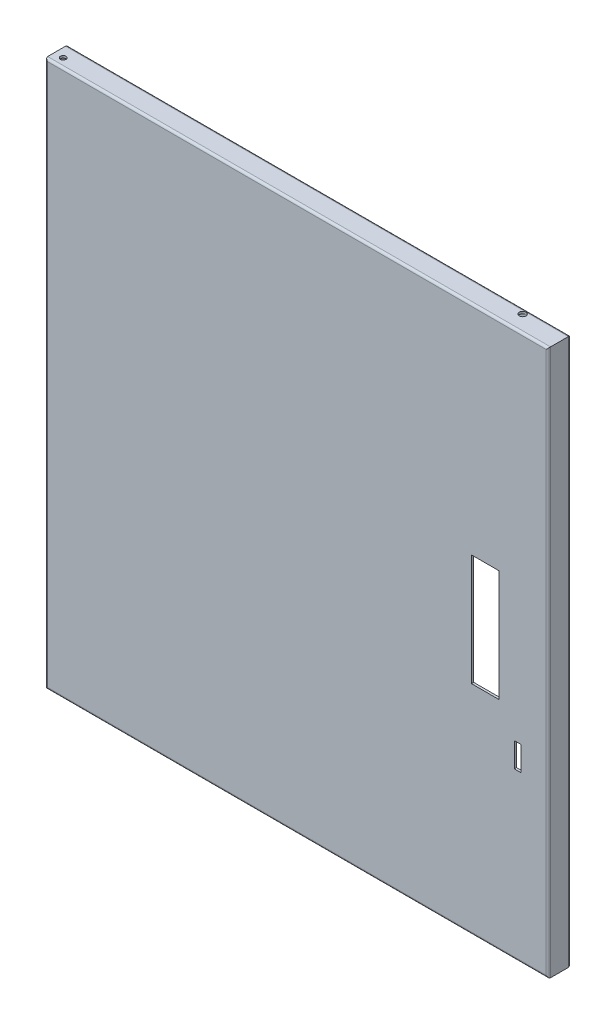
ISO-10303-21;
HEADER;
FILE_DESCRIPTION(('STEP AP214'),'2;1');
FILE_NAME('part.step','',(''),(''),'','','');
FILE_SCHEMA(('AUTOMOTIVE_DESIGN { 1 0 10303 214 1 1 1 1 }'));
ENDSEC;
DATA;
#1=APPLICATION_CONTEXT('core data for automotive mechanical design processes');
#2=APPLICATION_PROTOCOL_DEFINITION('international standard','automotive_design',2000,#1);
#3=PRODUCT_CONTEXT('',#1,'mechanical');
#4=PRODUCT('Part','Part','',(#3));
#5=PRODUCT_RELATED_PRODUCT_CATEGORY('part','',(#4));
#6=PRODUCT_DEFINITION_FORMATION('','',#4);
#7=PRODUCT_DEFINITION_CONTEXT('part definition',#1,'design');
#8=PRODUCT_DEFINITION('design','',#6,#7);
#9=PRODUCT_DEFINITION_SHAPE('','',#8);
#10=(LENGTH_UNIT() NAMED_UNIT(*) SI_UNIT(.MILLI.,.METRE.));
#11=(NAMED_UNIT(*) PLANE_ANGLE_UNIT() SI_UNIT($,.RADIAN.));
#12=(NAMED_UNIT(*) SI_UNIT($,.STERADIAN.) SOLID_ANGLE_UNIT());
#13=UNCERTAINTY_MEASURE_WITH_UNIT(LENGTH_MEASURE(1.E-05),#10,'distance_accuracy_value','');
#14=(GEOMETRIC_REPRESENTATION_CONTEXT(3) GLOBAL_UNCERTAINTY_ASSIGNED_CONTEXT((#13)) GLOBAL_UNIT_ASSIGNED_CONTEXT((#10,
#11,#12)) REPRESENTATION_CONTEXT('',''));
#15=CARTESIAN_POINT('',(0.,0.,0.));
#16=DIRECTION('',(0.,0.,1.));
#17=DIRECTION('',(1.,0.,0.));
#18=AXIS2_PLACEMENT_3D('',#15,#16,#17);
#19=CARTESIAN_POINT('',(0.,0.,20.));
#20=DIRECTION('',(0.,0.,1.));
#21=DIRECTION('',(1.,0.,0.));
#22=AXIS2_PLACEMENT_3D('',#19,#20,#21);
#23=PLANE('',#22);
#24=DIRECTION('',(0.,1.,0.));
#25=VECTOR('',#24,1.);
#26=CARTESIAN_POINT('',(181.5,0.,20.));
#27=LINE('',#26,#25);
#28=CARTESIAN_POINT('',(181.5,-50.,20.));
#29=VERTEX_POINT('',#28);
#30=CARTESIAN_POINT('',(181.5,50.,20.));
#31=VERTEX_POINT('',#30);
#32=EDGE_CURVE('E261',#29,#31,#27,.T.);
#33=ORIENTED_EDGE('',*,*,#32,.F.);
#34=DIRECTION('',(-1.,0.,0.));
#35=VECTOR('',#34,1.);
#36=CARTESIAN_POINT('',(0.,-50.,20.));
#37=LINE('',#36,#35);
#38=CARTESIAN_POINT('',(156.5,-50.,20.));
#39=VERTEX_POINT('',#38);
#40=EDGE_CURVE('E272',#29,#39,#37,.T.);
#41=ORIENTED_EDGE('',*,*,#40,.T.);
#42=DIRECTION('',(0.,1.,0.));
#43=VECTOR('',#42,1.);
#44=CARTESIAN_POINT('',(156.5,0.,20.));
#45=LINE('',#44,#43);
#46=CARTESIAN_POINT('',(156.5,50.,20.));
#47=VERTEX_POINT('',#46);
#48=EDGE_CURVE('E73',#39,#47,#45,.T.);
#49=ORIENTED_EDGE('',*,*,#48,.T.);
#50=DIRECTION('',(-1.,0.,0.));
#51=VECTOR('',#50,1.);
#52=CARTESIAN_POINT('',(0.,50.,20.));
#53=LINE('',#52,#51);
#54=EDGE_CURVE('E267',#31,#47,#53,.T.);
#55=ORIENTED_EDGE('',*,*,#54,.F.);
#56=EDGE_LOOP('',(#33,#41,#49,#55));
#57=FACE_BOUND('',#56,.T.);
#58=DIRECTION('',(-1.,0.,0.));
#59=VECTOR('',#58,1.);
#60=CARTESIAN_POINT('',(-225.5,243.,20.));
#61=LINE('',#60,#59);
#62=CARTESIAN_POINT('',(223.5,243.,20.));
#63=VERTEX_POINT('',#62);
#64=CARTESIAN_POINT('',(-223.5,243.,20.));
#65=VERTEX_POINT('',#64);
#66=EDGE_CURVE('E412',#63,#65,#61,.T.);
#67=ORIENTED_EDGE('',*,*,#66,.T.);
#68=DIRECTION('',(0.,-1.,0.));
#69=VECTOR('',#68,1.);
#70=CARTESIAN_POINT('',(-223.5,-245.,20.));
#71=LINE('',#70,#69);
#72=CARTESIAN_POINT('',(-223.5,-243.,20.));
#73=VERTEX_POINT('',#72);
#74=EDGE_CURVE('E418',#65,#73,#71,.T.);
#75=ORIENTED_EDGE('',*,*,#74,.T.);
#76=DIRECTION('',(1.,0.,0.));
#77=VECTOR('',#76,1.);
#78=CARTESIAN_POINT('',(225.5,-243.,20.));
#79=LINE('',#78,#77);
#80=CARTESIAN_POINT('',(223.5,-243.,20.));
#81=VERTEX_POINT('',#80);
#82=EDGE_CURVE('E416',#73,#81,#79,.T.);
#83=ORIENTED_EDGE('',*,*,#82,.T.);
#84=DIRECTION('',(0.,1.,0.));
#85=VECTOR('',#84,1.);
#86=CARTESIAN_POINT('',(223.5,245.,20.));
#87=LINE('',#86,#85);
#88=EDGE_CURVE('E414',#81,#63,#87,.T.);
#89=ORIENTED_EDGE('',*,*,#88,.T.);
#90=EDGE_LOOP('',(#67,#75,#83,#89));
#91=FACE_BOUND('',#90,.T.);
#92=DIRECTION('',(0.,1.,0.));
#93=VECTOR('',#92,1.);
#94=CARTESIAN_POINT('',(201.,0.,20.));
#95=LINE('',#94,#93);
#96=CARTESIAN_POINT('',(201.,-96.9999999999999,20.));
#97=VERTEX_POINT('',#96);
#98=CARTESIAN_POINT('',(201.,-75.,20.));
#99=VERTEX_POINT('',#98);
#100=EDGE_CURVE('E307',#97,#99,#95,.T.);
#101=ORIENTED_EDGE('',*,*,#100,.F.);
#102=DIRECTION('',(-1.,0.,0.));
#103=VECTOR('',#102,1.);
#104=CARTESIAN_POINT('',(0.,-96.9999999999999,20.));
#105=LINE('',#104,#103);
#106=CARTESIAN_POINT('',(195.,-96.9999999999999,20.));
#107=VERTEX_POINT('',#106);
#108=EDGE_CURVE('E81',#97,#107,#105,.T.);
#109=ORIENTED_EDGE('',*,*,#108,.T.);
#110=DIRECTION('',(0.,1.,0.));
#111=VECTOR('',#110,1.);
#112=CARTESIAN_POINT('',(195.,0.,20.));
#113=LINE('',#112,#111);
#114=CARTESIAN_POINT('',(195.,-75.,20.));
#115=VERTEX_POINT('',#114);
#116=EDGE_CURVE('E284',#107,#115,#113,.T.);
#117=ORIENTED_EDGE('',*,*,#116,.T.);
#118=DIRECTION('',(-1.,0.,0.));
#119=VECTOR('',#118,1.);
#120=CARTESIAN_POINT('',(0.,-75.,20.));
#121=LINE('',#120,#119);
#122=EDGE_CURVE('E296',#99,#115,#121,.T.);
#123=ORIENTED_EDGE('',*,*,#122,.F.);
#124=EDGE_LOOP('',(#101,#109,#117,#123));
#125=FACE_BOUND('',#124,.T.);
#126=ADVANCED_FACE('F56',(#57,#91,#125),#23,.T.);
#127=CARTESIAN_POINT('',(0.,0.,18.));
#128=DIRECTION('',(0.,0.,-1.));
#129=DIRECTION('',(-1.,0.,0.));
#130=AXIS2_PLACEMENT_3D('',#127,#128,#129);
#131=PLANE('',#130);
#132=DIRECTION('',(0.,1.,0.));
#133=VECTOR('',#132,1.);
#134=CARTESIAN_POINT('',(181.5,0.,18.));
#135=LINE('',#134,#133);
#136=CARTESIAN_POINT('',(181.5,-50.,18.));
#137=VERTEX_POINT('',#136);
#138=CARTESIAN_POINT('',(181.5,50.,18.));
#139=VERTEX_POINT('',#138);
#140=EDGE_CURVE('E258',#137,#139,#135,.T.);
#141=ORIENTED_EDGE('',*,*,#140,.T.);
#142=DIRECTION('',(-1.,0.,0.));
#143=VECTOR('',#142,1.);
#144=CARTESIAN_POINT('',(0.,50.,18.));
#145=LINE('',#144,#143);
#146=CARTESIAN_POINT('',(156.5,50.,18.));
#147=VERTEX_POINT('',#146);
#148=EDGE_CURVE('E244',#139,#147,#145,.T.);
#149=ORIENTED_EDGE('',*,*,#148,.T.);
#150=DIRECTION('',(0.,1.,0.));
#151=VECTOR('',#150,1.);
#152=CARTESIAN_POINT('',(156.5,0.,18.));
#153=LINE('',#152,#151);
#154=CARTESIAN_POINT('',(156.5,-50.,18.));
#155=VERTEX_POINT('',#154);
#156=EDGE_CURVE('E275',#155,#147,#153,.T.);
#157=ORIENTED_EDGE('',*,*,#156,.F.);
#158=DIRECTION('',(-1.,0.,0.));
#159=VECTOR('',#158,1.);
#160=CARTESIAN_POINT('',(0.,-50.,18.));
#161=LINE('',#160,#159);
#162=EDGE_CURVE('E266',#137,#155,#161,.T.);
#163=ORIENTED_EDGE('',*,*,#162,.F.);
#164=EDGE_LOOP('',(#141,#149,#157,#163));
#165=FACE_BOUND('',#164,.T.);
#166=DIRECTION('',(0.,1.,0.));
#167=VECTOR('',#166,1.);
#168=CARTESIAN_POINT('',(221.5,-243.,18.));
#169=LINE('',#168,#167);
#170=CARTESIAN_POINT('',(221.5,241.,18.));
#171=VERTEX_POINT('',#170);
#172=CARTESIAN_POINT('',(221.5,-241.,18.));
#173=VERTEX_POINT('',#172);
#174=EDGE_CURVE('E448',#171,#173,#169,.F.);
#175=ORIENTED_EDGE('',*,*,#174,.T.);
#176=DIRECTION('',(1.,0.,0.));
#177=VECTOR('',#176,1.);
#178=CARTESIAN_POINT('',(0.,-241.,18.));
#179=LINE('',#178,#177);
#180=CARTESIAN_POINT('',(-221.5,-241.,18.));
#181=VERTEX_POINT('',#180);
#182=EDGE_CURVE('E450',#173,#181,#179,.F.);
#183=ORIENTED_EDGE('',*,*,#182,.T.);
#184=DIRECTION('',(0.,-1.,0.));
#185=VECTOR('',#184,1.);
#186=CARTESIAN_POINT('',(-221.5,0.,18.));
#187=LINE('',#186,#185);
#188=CARTESIAN_POINT('',(-221.5,241.,18.));
#189=VERTEX_POINT('',#188);
#190=EDGE_CURVE('E444',#181,#189,#187,.F.);
#191=ORIENTED_EDGE('',*,*,#190,.T.);
#192=DIRECTION('',(-1.,0.,0.));
#193=VECTOR('',#192,1.);
#194=CARTESIAN_POINT('',(223.5,241.,18.));
#195=LINE('',#194,#193);
#196=EDGE_CURVE('E446',#189,#171,#195,.F.);
#197=ORIENTED_EDGE('',*,*,#196,.T.);
#198=EDGE_LOOP('',(#175,#183,#191,#197));
#199=FACE_BOUND('',#198,.T.);
#200=DIRECTION('',(0.,1.,0.));
#201=VECTOR('',#200,1.);
#202=CARTESIAN_POINT('',(195.,0.,18.));
#203=LINE('',#202,#201);
#204=CARTESIAN_POINT('',(195.,-96.9999999999999,18.));
#205=VERTEX_POINT('',#204);
#206=CARTESIAN_POINT('',(195.,-75.,18.));
#207=VERTEX_POINT('',#206);
#208=EDGE_CURVE('E297',#205,#207,#203,.T.);
#209=ORIENTED_EDGE('',*,*,#208,.F.);
#210=DIRECTION('',(-1.,0.,0.));
#211=VECTOR('',#210,1.);
#212=CARTESIAN_POINT('',(0.,-96.9999999999999,18.));
#213=LINE('',#212,#211);
#214=CARTESIAN_POINT('',(201.,-96.9999999999999,18.));
#215=VERTEX_POINT('',#214);
#216=EDGE_CURVE('E293',#215,#205,#213,.T.);
#217=ORIENTED_EDGE('',*,*,#216,.F.);
#218=DIRECTION('',(0.,1.,0.));
#219=VECTOR('',#218,1.);
#220=CARTESIAN_POINT('',(201.,0.,18.));
#221=LINE('',#220,#219);
#222=CARTESIAN_POINT('',(201.,-75.,18.));
#223=VERTEX_POINT('',#222);
#224=EDGE_CURVE('E289',#215,#223,#221,.T.);
#225=ORIENTED_EDGE('',*,*,#224,.T.);
#226=DIRECTION('',(-1.,0.,0.));
#227=VECTOR('',#226,1.);
#228=CARTESIAN_POINT('',(0.,-75.,18.));
#229=LINE('',#228,#227);
#230=EDGE_CURVE('E292',#223,#207,#229,.T.);
#231=ORIENTED_EDGE('',*,*,#230,.T.);
#232=EDGE_LOOP('',(#209,#217,#225,#231));
#233=FACE_BOUND('',#232,.T.);
#234=ADVANCED_FACE('F264',(#165,#199,#233),#131,.T.);
#235=CARTESIAN_POINT('',(225.5,245.,20.));
#236=DIRECTION('',(-1.,0.,0.));
#237=DIRECTION('',(0.,-1.,0.));
#238=AXIS2_PLACEMENT_3D('',#235,#236,#237);
#239=PLANE('',#238);
#240=DIRECTION('',(0.,0.,-1.));
#241=VECTOR('',#240,1.);
#242=CARTESIAN_POINT('',(225.5,-245.,20.));
#243=LINE('',#242,#241);
#244=CARTESIAN_POINT('',(225.5,-245.,18.));
#245=VERTEX_POINT('',#244);
#246=CARTESIAN_POINT('',(225.5,-245.,2.));
#247=VERTEX_POINT('',#246);
#248=EDGE_CURVE('E365',#245,#247,#243,.T.);
#249=ORIENTED_EDGE('',*,*,#248,.T.);
#250=DIRECTION('',(0.,1.,0.));
#251=VECTOR('',#250,1.);
#252=CARTESIAN_POINT('',(225.5,245.,2.));
#253=LINE('',#252,#251);
#254=CARTESIAN_POINT('',(225.5,245.,2.));
#255=VERTEX_POINT('',#254);
#256=EDGE_CURVE('E392',#247,#255,#253,.T.);
#257=ORIENTED_EDGE('',*,*,#256,.T.);
#258=DIRECTION('',(0.,0.,-1.));
#259=VECTOR('',#258,1.);
#260=CARTESIAN_POINT('',(225.5,245.,20.));
#261=LINE('',#260,#259);
#262=CARTESIAN_POINT('',(225.5,245.,18.));
#263=VERTEX_POINT('',#262);
#264=EDGE_CURVE('E376',#263,#255,#261,.T.);
#265=ORIENTED_EDGE('',*,*,#264,.F.);
#266=DIRECTION('',(0.,1.,0.));
#267=VECTOR('',#266,1.);
#268=CARTESIAN_POINT('',(225.5,-245.,18.));
#269=LINE('',#268,#267);
#270=EDGE_CURVE('E390',#263,#245,#269,.F.);
#271=ORIENTED_EDGE('',*,*,#270,.T.);
#272=EDGE_LOOP('',(#249,#257,#265,#271));
#273=FACE_BOUND('',#272,.T.);
#274=ADVANCED_FACE('F523',(#273),#239,.F.);
#275=CARTESIAN_POINT('',(-225.5,245.,20.));
#276=DIRECTION('',(0.,-1.,0.));
#277=DIRECTION('',(0.,0.,-1.));
#278=AXIS2_PLACEMENT_3D('',#275,#276,#277);
#279=PLANE('',#278);
#280=CARTESIAN_POINT('',(-217.5,245.,12.));
#281=DIRECTION('',(0.,1.,0.));
#282=DIRECTION('',(0.,0.,1.));
#283=AXIS2_PLACEMENT_3D('',#280,#281,#282);
#284=CIRCLE('',#283,2.5);
#285=CARTESIAN_POINT('',(-217.5,245.,14.5));
#286=VERTEX_POINT('',#285);
#287=EDGE_CURVE('E321',#286,#286,#284,.T.);
#288=ORIENTED_EDGE('',*,*,#287,.F.);
#289=EDGE_LOOP('',(#288));
#290=FACE_BOUND('',#289,.T.);
#291=DIRECTION('',(-1.,0.,0.));
#292=VECTOR('',#291,1.);
#293=CARTESIAN_POINT('',(-225.5,245.,2.));
#294=LINE('',#293,#292);
#295=CARTESIAN_POINT('',(187.5,245.,2.));
#296=VERTEX_POINT('',#295);
#297=EDGE_CURVE('E398',#255,#296,#294,.T.);
#298=ORIENTED_EDGE('',*,*,#297,.T.);
#299=CARTESIAN_POINT('',(187.5,245.,5.));
#300=DIRECTION('',(0.,1.,0.));
#301=DIRECTION('',(0.,0.,1.));
#302=AXIS2_PLACEMENT_3D('',#299,#300,#301);
#303=CIRCLE('',#302,2.99999999999999);
#304=EDGE_CURVE('E316',#296,#296,#303,.T.);
#305=ORIENTED_EDGE('',*,*,#304,.F.);
#306=CARTESIAN_POINT('',(-225.5,245.,2.));
#307=VERTEX_POINT('',#306);
#308=EDGE_CURVE('E397',#296,#307,#294,.T.);
#309=ORIENTED_EDGE('',*,*,#308,.T.);
#310=DIRECTION('',(0.,0.,-1.));
#311=VECTOR('',#310,1.);
#312=CARTESIAN_POINT('',(-225.5,245.,20.));
#313=LINE('',#312,#311);
#314=CARTESIAN_POINT('',(-225.5,245.,18.));
#315=VERTEX_POINT('',#314);
#316=EDGE_CURVE('E373',#315,#307,#313,.T.);
#317=ORIENTED_EDGE('',*,*,#316,.F.);
#318=DIRECTION('',(-1.,0.,0.));
#319=VECTOR('',#318,1.);
#320=CARTESIAN_POINT('',(225.5,245.,18.));
#321=LINE('',#320,#319);
#322=EDGE_CURVE('E395',#315,#263,#321,.F.);
#323=ORIENTED_EDGE('',*,*,#322,.T.);
#324=ORIENTED_EDGE('',*,*,#264,.T.);
#325=EDGE_LOOP('',(#298,#305,#309,#317,#323,#324));
#326=FACE_BOUND('',#325,.T.);
#327=ADVANCED_FACE('F538',(#290,#326),#279,.F.);
#328=CARTESIAN_POINT('',(-225.5,245.,20.));
#329=DIRECTION('',(1.,0.,0.));
#330=DIRECTION('',(0.,1.,0.));
#331=AXIS2_PLACEMENT_3D('',#328,#329,#330);
#332=PLANE('',#331);
#333=ORIENTED_EDGE('',*,*,#316,.T.);
#334=DIRECTION('',(0.,-1.,0.));
#335=VECTOR('',#334,1.);
#336=CARTESIAN_POINT('',(-225.5,245.,2.));
#337=LINE('',#336,#335);
#338=CARTESIAN_POINT('',(-225.5,-245.,2.));
#339=VERTEX_POINT('',#338);
#340=EDGE_CURVE('E410',#307,#339,#337,.T.);
#341=ORIENTED_EDGE('',*,*,#340,.T.);
#342=DIRECTION('',(0.,0.,-1.));
#343=VECTOR('',#342,1.);
#344=CARTESIAN_POINT('',(-225.5,-245.,20.));
#345=LINE('',#344,#343);
#346=CARTESIAN_POINT('',(-225.5,-245.,18.));
#347=VERTEX_POINT('',#346);
#348=EDGE_CURVE('E370',#347,#339,#345,.T.);
#349=ORIENTED_EDGE('',*,*,#348,.F.);
#350=DIRECTION('',(0.,-1.,0.));
#351=VECTOR('',#350,1.);
#352=CARTESIAN_POINT('',(-225.5,245.,18.));
#353=LINE('',#352,#351);
#354=EDGE_CURVE('E407',#347,#315,#353,.F.);
#355=ORIENTED_EDGE('',*,*,#354,.T.);
#356=EDGE_LOOP('',(#333,#341,#349,#355));
#357=FACE_BOUND('',#356,.T.);
#358=ADVANCED_FACE('F534',(#357),#332,.F.);
#359=CARTESIAN_POINT('',(-225.5,-245.,20.));
#360=DIRECTION('',(0.,1.,0.));
#361=DIRECTION('',(0.,0.,1.));
#362=AXIS2_PLACEMENT_3D('',#359,#360,#361);
#363=PLANE('',#362);
#364=CARTESIAN_POINT('',(-217.5,-245.,12.));
#365=DIRECTION('',(0.,1.,0.));
#366=DIRECTION('',(0.,0.,1.));
#367=AXIS2_PLACEMENT_3D('',#364,#365,#366);
#368=CIRCLE('',#367,2.5);
#369=CARTESIAN_POINT('',(-217.5,-245.,14.5));
#370=VERTEX_POINT('',#369);
#371=EDGE_CURVE('E322',#370,#370,#368,.T.);
#372=ORIENTED_EDGE('',*,*,#371,.T.);
#373=EDGE_LOOP('',(#372));
#374=FACE_BOUND('',#373,.T.);
#375=DIRECTION('',(1.,0.,0.));
#376=VECTOR('',#375,1.);
#377=CARTESIAN_POINT('',(-225.5,-245.,2.));
#378=LINE('',#377,#376);
#379=CARTESIAN_POINT('',(150.5,-245.,2.));
#380=VERTEX_POINT('',#379);
#381=EDGE_CURVE('E404',#339,#380,#378,.T.);
#382=ORIENTED_EDGE('',*,*,#381,.T.);
#383=CARTESIAN_POINT('',(150.5,-245.,5.));
#384=DIRECTION('',(0.,-1.,0.));
#385=DIRECTION('',(0.,0.,-1.));
#386=AXIS2_PLACEMENT_3D('',#383,#384,#385);
#387=CIRCLE('',#386,2.99999999999999);
#388=EDGE_CURVE('E312',#380,#380,#387,.T.);
#389=ORIENTED_EDGE('',*,*,#388,.F.);
#390=EDGE_CURVE('E403',#380,#247,#378,.T.);
#391=ORIENTED_EDGE('',*,*,#390,.T.);
#392=ORIENTED_EDGE('',*,*,#248,.F.);
#393=DIRECTION('',(1.,0.,0.));
#394=VECTOR('',#393,1.);
#395=CARTESIAN_POINT('',(-225.5,-245.,18.));
#396=LINE('',#395,#394);
#397=EDGE_CURVE('E401',#245,#347,#396,.F.);
#398=ORIENTED_EDGE('',*,*,#397,.T.);
#399=ORIENTED_EDGE('',*,*,#348,.T.);
#400=EDGE_LOOP('',(#382,#389,#391,#392,#398,#399));
#401=FACE_BOUND('',#400,.T.);
#402=ADVANCED_FACE('F530',(#374,#401),#363,.F.);
#403=CARTESIAN_POINT('',(0.,0.,0.));
#404=DIRECTION('',(0.,0.,1.));
#405=DIRECTION('',(1.,0.,0.));
#406=AXIS2_PLACEMENT_3D('',#403,#404,#405);
#407=PLANE('',#406);
#408=DIRECTION('',(-1.,0.,0.));
#409=VECTOR('',#408,1.);
#410=CARTESIAN_POINT('',(0.,243.,0.));
#411=LINE('',#410,#409);
#412=CARTESIAN_POINT('',(-223.5,243.,0.));
#413=VERTEX_POINT('',#412);
#414=CARTESIAN_POINT('',(223.5,243.,0.));
#415=VERTEX_POINT('',#414);
#416=EDGE_CURVE('E383',#413,#415,#411,.F.);
#417=ORIENTED_EDGE('',*,*,#416,.T.);
#418=DIRECTION('',(0.,1.,0.));
#419=VECTOR('',#418,1.);
#420=CARTESIAN_POINT('',(223.5,0.,0.));
#421=LINE('',#420,#419);
#422=CARTESIAN_POINT('',(223.5,-243.,0.));
#423=VERTEX_POINT('',#422);
#424=EDGE_CURVE('E385',#415,#423,#421,.F.);
#425=ORIENTED_EDGE('',*,*,#424,.T.);
#426=DIRECTION('',(1.,0.,0.));
#427=VECTOR('',#426,1.);
#428=CARTESIAN_POINT('',(0.,-243.,0.));
#429=LINE('',#428,#427);
#430=CARTESIAN_POINT('',(-223.5,-243.,0.));
#431=VERTEX_POINT('',#430);
#432=EDGE_CURVE('E381',#423,#431,#429,.F.);
#433=ORIENTED_EDGE('',*,*,#432,.T.);
#434=DIRECTION('',(0.,-1.,0.));
#435=VECTOR('',#434,1.);
#436=CARTESIAN_POINT('',(-223.5,0.,0.));
#437=LINE('',#436,#435);
#438=EDGE_CURVE('E379',#431,#413,#437,.F.);
#439=ORIENTED_EDGE('',*,*,#438,.T.);
#440=EDGE_LOOP('',(#417,#425,#433,#439));
#441=FACE_BOUND('',#440,.T.);
#442=DIRECTION('',(-1.,0.,0.));
#443=VECTOR('',#442,1.);
#444=CARTESIAN_POINT('',(0.,-236.,0.));
#445=LINE('',#444,#443);
#446=CARTESIAN_POINT('',(-216.5,-236.,0.));
#447=VERTEX_POINT('',#446);
#448=CARTESIAN_POINT('',(216.5,-236.,0.));
#449=VERTEX_POINT('',#448);
#450=EDGE_CURVE('E463',#447,#449,#445,.F.);
#451=ORIENTED_EDGE('',*,*,#450,.T.);
#452=DIRECTION('',(0.,-1.,0.));
#453=VECTOR('',#452,1.);
#454=CARTESIAN_POINT('',(216.5,0.,0.));
#455=LINE('',#454,#453);
#456=CARTESIAN_POINT('',(216.5,236.,0.));
#457=VERTEX_POINT('',#456);
#458=EDGE_CURVE('E388',#449,#457,#455,.F.);
#459=ORIENTED_EDGE('',*,*,#458,.T.);
#460=DIRECTION('',(1.,0.,0.));
#461=VECTOR('',#460,1.);
#462=CARTESIAN_POINT('',(0.,236.,0.));
#463=LINE('',#462,#461);
#464=CARTESIAN_POINT('',(-216.5,236.,0.));
#465=VERTEX_POINT('',#464);
#466=EDGE_CURVE('E459',#457,#465,#463,.F.);
#467=ORIENTED_EDGE('',*,*,#466,.T.);
#468=DIRECTION('',(0.,1.,0.));
#469=VECTOR('',#468,1.);
#470=CARTESIAN_POINT('',(-216.5,0.,0.));
#471=LINE('',#470,#469);
#472=EDGE_CURVE('E461',#465,#447,#471,.F.);
#473=ORIENTED_EDGE('',*,*,#472,.T.);
#474=EDGE_LOOP('',(#451,#459,#467,#473));
#475=FACE_BOUND('',#474,.T.);
#476=ADVANCED_FACE('F489',(#441,#475),#407,.F.);
#477=CARTESIAN_POINT('',(-223.5,-234.,2.));
#478=DIRECTION('',(0.,0.,-1.));
#479=DIRECTION('',(-1.,0.,0.));
#480=AXIS2_PLACEMENT_3D('',#477,#478,#479);
#481=PLANE('',#480);
#482=DIRECTION('',(1.,0.,0.));
#483=VECTOR('',#482,1.);
#484=CARTESIAN_POINT('',(-223.5,234.,2.));
#485=LINE('',#484,#483);
#486=CARTESIAN_POINT('',(-214.5,234.,2.));
#487=VERTEX_POINT('',#486);
#488=CARTESIAN_POINT('',(214.5,234.,2.));
#489=VERTEX_POINT('',#488);
#490=EDGE_CURVE('E334',#487,#489,#485,.T.);
#491=ORIENTED_EDGE('',*,*,#490,.T.);
#492=DIRECTION('',(0.,-1.,0.));
#493=VECTOR('',#492,1.);
#494=CARTESIAN_POINT('',(214.5,-243.,2.));
#495=LINE('',#494,#493);
#496=CARTESIAN_POINT('',(214.5,-234.,2.));
#497=VERTEX_POINT('',#496);
#498=EDGE_CURVE('E341',#489,#497,#495,.T.);
#499=ORIENTED_EDGE('',*,*,#498,.T.);
#500=DIRECTION('',(-1.,0.,0.));
#501=VECTOR('',#500,1.);
#502=CARTESIAN_POINT('',(-223.5,-234.,2.));
#503=LINE('',#502,#501);
#504=CARTESIAN_POINT('',(-214.5,-234.,2.));
#505=VERTEX_POINT('',#504);
#506=EDGE_CURVE('E350',#497,#505,#503,.T.);
#507=ORIENTED_EDGE('',*,*,#506,.T.);
#508=DIRECTION('',(0.,1.,0.));
#509=VECTOR('',#508,1.);
#510=CARTESIAN_POINT('',(-214.5,-234.,2.));
#511=LINE('',#510,#509);
#512=EDGE_CURVE('E360',#505,#487,#511,.T.);
#513=ORIENTED_EDGE('',*,*,#512,.T.);
#514=EDGE_LOOP('',(#491,#499,#507,#513));
#515=FACE_BOUND('',#514,.T.);
#516=DIRECTION('',(0.,-1.,0.));
#517=VECTOR('',#516,1.);
#518=CARTESIAN_POINT('',(223.5,-243.,2.));
#519=LINE('',#518,#517);
#520=CARTESIAN_POINT('',(223.5,243.,2.));
#521=VERTEX_POINT('',#520);
#522=CARTESIAN_POINT('',(223.5,-243.,2.));
#523=VERTEX_POINT('',#522);
#524=EDGE_CURVE('E344',#521,#523,#519,.T.);
#525=ORIENTED_EDGE('',*,*,#524,.F.);
#526=DIRECTION('',(1.,0.,0.));
#527=VECTOR('',#526,1.);
#528=CARTESIAN_POINT('',(-223.5,243.,2.));
#529=LINE('',#528,#527);
#530=CARTESIAN_POINT('',(187.5,243.,2.));
#531=VERTEX_POINT('',#530);
#532=EDGE_CURVE('E333',#531,#521,#529,.T.);
#533=ORIENTED_EDGE('',*,*,#532,.F.);
#534=CARTESIAN_POINT('',(-223.5,243.,2.));
#535=VERTEX_POINT('',#534);
#536=EDGE_CURVE('E335',#535,#531,#529,.T.);
#537=ORIENTED_EDGE('',*,*,#536,.F.);
#538=DIRECTION('',(0.,1.,0.));
#539=VECTOR('',#538,1.);
#540=CARTESIAN_POINT('',(-223.5,-234.,2.));
#541=LINE('',#540,#539);
#542=CARTESIAN_POINT('',(-223.5,-243.,2.));
#543=VERTEX_POINT('',#542);
#544=EDGE_CURVE('E362',#543,#535,#541,.T.);
#545=ORIENTED_EDGE('',*,*,#544,.F.);
#546=DIRECTION('',(-1.,0.,0.));
#547=VECTOR('',#546,1.);
#548=CARTESIAN_POINT('',(-223.5,-243.,2.));
#549=LINE('',#548,#547);
#550=CARTESIAN_POINT('',(150.5,-243.,2.));
#551=VERTEX_POINT('',#550);
#552=EDGE_CURVE('E356',#551,#543,#549,.T.);
#553=ORIENTED_EDGE('',*,*,#552,.F.);
#554=EDGE_CURVE('E357',#523,#551,#549,.T.);
#555=ORIENTED_EDGE('',*,*,#554,.F.);
#556=EDGE_LOOP('',(#525,#533,#537,#545,#553,#555));
#557=FACE_BOUND('',#556,.T.);
#558=ADVANCED_FACE('F497',(#515,#557),#481,.F.);
#559=CARTESIAN_POINT('',(-223.5,0.,0.));
#560=DIRECTION('',(-1.,0.,0.));
#561=DIRECTION('',(0.,-1.,0.));
#562=AXIS2_PLACEMENT_3D('',#559,#560,#561);
#563=PLANE('',#562);
#564=DIRECTION('',(0.,0.,-1.));
#565=VECTOR('',#564,1.);
#566=CARTESIAN_POINT('',(-223.5,243.,18.));
#567=LINE('',#566,#565);
#568=CARTESIAN_POINT('',(-223.5,243.,16.));
#569=VERTEX_POINT('',#568);
#570=EDGE_CURVE('E331',#569,#535,#567,.T.);
#571=ORIENTED_EDGE('',*,*,#570,.F.);
#572=DIRECTION('',(0.,-1.,0.));
#573=VECTOR('',#572,1.);
#574=CARTESIAN_POINT('',(-223.5,0.,16.));
#575=LINE('',#574,#573);
#576=CARTESIAN_POINT('',(-223.5,-243.,16.));
#577=VERTEX_POINT('',#576);
#578=EDGE_CURVE('E457',#569,#577,#575,.T.);
#579=ORIENTED_EDGE('',*,*,#578,.T.);
#580=DIRECTION('',(0.,0.,1.));
#581=VECTOR('',#580,1.);
#582=CARTESIAN_POINT('',(-223.5,-243.,18.));
#583=LINE('',#582,#581);
#584=EDGE_CURVE('E353',#543,#577,#583,.T.);
#585=ORIENTED_EDGE('',*,*,#584,.F.);
#586=ORIENTED_EDGE('',*,*,#544,.T.);
#587=EDGE_LOOP('',(#571,#579,#585,#586));
#588=FACE_BOUND('',#587,.T.);
#589=ADVANCED_FACE('F668',(#588),#563,.F.);
#590=CARTESIAN_POINT('',(0.,-243.,0.));
#591=DIRECTION('',(0.,-1.,0.));
#592=DIRECTION('',(0.,0.,-1.));
#593=AXIS2_PLACEMENT_3D('',#590,#591,#592);
#594=PLANE('',#593);
#595=CARTESIAN_POINT('',(-217.5,-243.,12.));
#596=DIRECTION('',(0.,-1.,0.));
#597=DIRECTION('',(0.,0.,-1.));
#598=AXIS2_PLACEMENT_3D('',#595,#596,#597);
#599=CIRCLE('',#598,2.5);
#600=CARTESIAN_POINT('',(-217.5,-243.,9.50000000000001));
#601=VERTEX_POINT('',#600);
#602=EDGE_CURVE('E327',#601,#601,#599,.T.);
#603=ORIENTED_EDGE('',*,*,#602,.T.);
#604=EDGE_LOOP('',(#603));
#605=FACE_BOUND('',#604,.T.);
#606=ORIENTED_EDGE('',*,*,#554,.T.);
#607=CARTESIAN_POINT('',(150.5,-243.,5.));
#608=DIRECTION('',(0.,-1.,0.));
#609=DIRECTION('',(0.,0.,-1.));
#610=AXIS2_PLACEMENT_3D('',#607,#608,#609);
#611=CIRCLE('',#610,2.99999999999999);
#612=EDGE_CURVE('E314',#551,#551,#611,.F.);
#613=ORIENTED_EDGE('',*,*,#612,.F.);
#614=ORIENTED_EDGE('',*,*,#552,.T.);
#615=ORIENTED_EDGE('',*,*,#584,.T.);
#616=DIRECTION('',(1.,0.,0.));
#617=VECTOR('',#616,1.);
#618=CARTESIAN_POINT('',(0.,-243.,16.));
#619=LINE('',#618,#617);
#620=CARTESIAN_POINT('',(223.5,-243.,16.));
#621=VERTEX_POINT('',#620);
#622=EDGE_CURVE('E421',#577,#621,#619,.T.);
#623=ORIENTED_EDGE('',*,*,#622,.T.);
#624=DIRECTION('',(0.,0.,1.));
#625=VECTOR('',#624,1.);
#626=CARTESIAN_POINT('',(223.5,-243.,18.));
#627=LINE('',#626,#625);
#628=EDGE_CURVE('E347',#523,#621,#627,.T.);
#629=ORIENTED_EDGE('',*,*,#628,.F.);
#630=EDGE_LOOP('',(#606,#613,#614,#615,#623,#629));
#631=FACE_BOUND('',#630,.T.);
#632=ADVANCED_FACE('F659',(#605,#631),#594,.F.);
#633=CARTESIAN_POINT('',(223.5,0.,0.));
#634=DIRECTION('',(-1.,0.,0.));
#635=DIRECTION('',(0.,-1.,0.));
#636=AXIS2_PLACEMENT_3D('',#633,#634,#635);
#637=PLANE('',#636);
#638=ORIENTED_EDGE('',*,*,#628,.T.);
#639=DIRECTION('',(0.,1.,0.));
#640=VECTOR('',#639,1.);
#641=CARTESIAN_POINT('',(223.5,243.,16.));
#642=LINE('',#641,#640);
#643=CARTESIAN_POINT('',(223.5,243.,16.));
#644=VERTEX_POINT('',#643);
#645=EDGE_CURVE('E453',#621,#644,#642,.T.);
#646=ORIENTED_EDGE('',*,*,#645,.T.);
#647=DIRECTION('',(0.,0.,1.));
#648=VECTOR('',#647,1.);
#649=CARTESIAN_POINT('',(223.5,243.,18.));
#650=LINE('',#649,#648);
#651=EDGE_CURVE('E338',#521,#644,#650,.T.);
#652=ORIENTED_EDGE('',*,*,#651,.F.);
#653=ORIENTED_EDGE('',*,*,#524,.T.);
#654=EDGE_LOOP('',(#638,#646,#652,#653));
#655=FACE_BOUND('',#654,.T.);
#656=ADVANCED_FACE('F512',(#655),#637,.T.);
#657=CARTESIAN_POINT('',(0.,243.,0.));
#658=DIRECTION('',(0.,-1.,0.));
#659=DIRECTION('',(0.,0.,-1.));
#660=AXIS2_PLACEMENT_3D('',#657,#658,#659);
#661=PLANE('',#660);
#662=CARTESIAN_POINT('',(-217.5,243.,12.));
#663=DIRECTION('',(0.,-1.,0.));
#664=DIRECTION('',(0.,0.,-1.));
#665=AXIS2_PLACEMENT_3D('',#662,#663,#664);
#666=CIRCLE('',#665,2.5);
#667=CARTESIAN_POINT('',(-217.5,243.,9.50000000000001));
#668=VERTEX_POINT('',#667);
#669=EDGE_CURVE('E60',#668,#668,#666,.T.);
#670=ORIENTED_EDGE('',*,*,#669,.F.);
#671=EDGE_LOOP('',(#670));
#672=FACE_BOUND('',#671,.T.);
#673=ORIENTED_EDGE('',*,*,#536,.T.);
#674=CARTESIAN_POINT('',(187.5,243.,5.));
#675=DIRECTION('',(0.,-1.,0.));
#676=DIRECTION('',(0.,0.,-1.));
#677=AXIS2_PLACEMENT_3D('',#674,#675,#676);
#678=CIRCLE('',#677,2.99999999999999);
#679=EDGE_CURVE('E318',#531,#531,#678,.F.);
#680=ORIENTED_EDGE('',*,*,#679,.T.);
#681=ORIENTED_EDGE('',*,*,#532,.T.);
#682=ORIENTED_EDGE('',*,*,#651,.T.);
#683=DIRECTION('',(-1.,0.,0.));
#684=VECTOR('',#683,1.);
#685=CARTESIAN_POINT('',(-223.5,243.,16.));
#686=LINE('',#685,#684);
#687=EDGE_CURVE('E455',#644,#569,#686,.T.);
#688=ORIENTED_EDGE('',*,*,#687,.T.);
#689=ORIENTED_EDGE('',*,*,#570,.T.);
#690=EDGE_LOOP('',(#673,#680,#681,#682,#688,#689));
#691=FACE_BOUND('',#690,.T.);
#692=ADVANCED_FACE('F503',(#672,#691),#661,.T.);
#693=CARTESIAN_POINT('',(216.5,234.,2.));
#694=DIRECTION('',(0.,-1.,0.));
#695=DIRECTION('',(1.,0.,0.));
#696=AXIS2_PLACEMENT_3D('',#693,#694,#695);
#697=CYLINDRICAL_SURFACE('',#696,2.);
#698=ORIENTED_EDGE('',*,*,#498,.F.);
#699=CARTESIAN_POINT('',(216.5,236.,2.));
#700=DIRECTION('',(0.707106781186547,-0.707106781186548,0.));
#701=DIRECTION('',(0.707106781186548,0.707106781186547,0.));
#702=AXIS2_PLACEMENT_3D('',#699,#700,#701);
#703=ELLIPSE('',#702,2.82842712474619,2.);
#704=EDGE_CURVE('E12',#489,#457,#703,.T.);
#705=ORIENTED_EDGE('',*,*,#704,.T.);
#706=ORIENTED_EDGE('',*,*,#458,.F.);
#707=CARTESIAN_POINT('',(216.5,-236.,2.));
#708=DIRECTION('',(-0.707106781186548,-0.707106781186547,0.));
#709=DIRECTION('',(-0.707106781186547,0.707106781186548,0.));
#710=AXIS2_PLACEMENT_3D('',#707,#708,#709);
#711=ELLIPSE('',#710,2.82842712474619,2.);
#712=EDGE_CURVE('E65',#449,#497,#711,.F.);
#713=ORIENTED_EDGE('',*,*,#712,.T.);
#714=EDGE_LOOP('',(#698,#705,#706,#713));
#715=FACE_BOUND('',#714,.T.);
#716=ADVANCED_FACE('F500',(#715),#697,.T.);
#717=CARTESIAN_POINT('',(-223.5,245.,2.));
#718=DIRECTION('',(0.,-1.,0.));
#719=DIRECTION('',(1.,0.,0.));
#720=AXIS2_PLACEMENT_3D('',#717,#718,#719);
#721=CYLINDRICAL_SURFACE('',#720,2.);
#722=CARTESIAN_POINT('',(-223.5,243.,2.));
#723=DIRECTION('',(-0.707106781186547,-0.707106781186548,0.));
#724=DIRECTION('',(0.707106781186548,-0.707106781186547,0.));
#725=AXIS2_PLACEMENT_3D('',#722,#723,#724);
#726=ELLIPSE('',#725,2.82842712474619,2.);
#727=EDGE_CURVE('E427',#413,#307,#726,.F.);
#728=ORIENTED_EDGE('',*,*,#727,.F.);
#729=ORIENTED_EDGE('',*,*,#438,.F.);
#730=CARTESIAN_POINT('',(-223.5,-243.,2.));
#731=DIRECTION('',(0.707106781186548,-0.707106781186547,0.));
#732=DIRECTION('',(-0.707106781186547,-0.707106781186548,0.));
#733=AXIS2_PLACEMENT_3D('',#730,#731,#732);
#734=ELLIPSE('',#733,2.82842712474619,2.);
#735=EDGE_CURVE('E343',#339,#431,#734,.T.);
#736=ORIENTED_EDGE('',*,*,#735,.F.);
#737=ORIENTED_EDGE('',*,*,#340,.F.);
#738=EDGE_LOOP('',(#728,#729,#736,#737));
#739=FACE_BOUND('',#738,.T.);
#740=ADVANCED_FACE('F502',(#739),#721,.T.);
#741=CARTESIAN_POINT('',(-225.5,-243.,2.));
#742=DIRECTION('',(1.,0.,0.));
#743=DIRECTION('',(0.,0.,-1.));
#744=AXIS2_PLACEMENT_3D('',#741,#742,#743);
#745=CYLINDRICAL_SURFACE('',#744,2.);
#746=ORIENTED_EDGE('',*,*,#735,.T.);
#747=ORIENTED_EDGE('',*,*,#432,.F.);
#748=CARTESIAN_POINT('',(223.5,-243.,2.));
#749=DIRECTION('',(0.707106781186547,0.707106781186548,0.));
#750=DIRECTION('',(0.707106781186548,-0.707106781186547,0.));
#751=AXIS2_PLACEMENT_3D('',#748,#749,#750);
#752=ELLIPSE('',#751,2.82842712474619,2.);
#753=EDGE_CURVE('E424',#247,#423,#752,.T.);
#754=ORIENTED_EDGE('',*,*,#753,.F.);
#755=ORIENTED_EDGE('',*,*,#390,.F.);
#756=ORIENTED_EDGE('',*,*,#381,.F.);
#757=EDGE_LOOP('',(#746,#747,#754,#755,#756));
#758=FACE_BOUND('',#757,.T.);
#759=ADVANCED_FACE('F509',(#758),#745,.T.);
#760=CARTESIAN_POINT('',(-225.5,243.,2.));
#761=DIRECTION('',(-1.,0.,0.));
#762=DIRECTION('',(0.,0.,1.));
#763=AXIS2_PLACEMENT_3D('',#760,#761,#762);
#764=CYLINDRICAL_SURFACE('',#763,2.);
#765=ORIENTED_EDGE('',*,*,#727,.T.);
#766=ORIENTED_EDGE('',*,*,#308,.F.);
#767=ORIENTED_EDGE('',*,*,#297,.F.);
#768=CARTESIAN_POINT('',(223.5,243.,2.));
#769=DIRECTION('',(-0.707106781186548,0.707106781186547,0.));
#770=DIRECTION('',(-0.707106781186547,-0.707106781186548,0.));
#771=AXIS2_PLACEMENT_3D('',#768,#769,#770);
#772=ELLIPSE('',#771,2.82842712474619,2.);
#773=EDGE_CURVE('E422',#415,#255,#772,.F.);
#774=ORIENTED_EDGE('',*,*,#773,.F.);
#775=ORIENTED_EDGE('',*,*,#416,.F.);
#776=EDGE_LOOP('',(#765,#766,#767,#774,#775));
#777=FACE_BOUND('',#776,.T.);
#778=ADVANCED_FACE('F565',(#777),#764,.T.);
#779=CARTESIAN_POINT('',(223.5,245.,2.));
#780=DIRECTION('',(0.,1.,0.));
#781=DIRECTION('',(-1.,0.,0.));
#782=AXIS2_PLACEMENT_3D('',#779,#780,#781);
#783=CYLINDRICAL_SURFACE('',#782,2.);
#784=ORIENTED_EDGE('',*,*,#753,.T.);
#785=ORIENTED_EDGE('',*,*,#424,.F.);
#786=ORIENTED_EDGE('',*,*,#773,.T.);
#787=ORIENTED_EDGE('',*,*,#256,.F.);
#788=EDGE_LOOP('',(#784,#785,#786,#787));
#789=FACE_BOUND('',#788,.T.);
#790=ADVANCED_FACE('F559',(#789),#783,.T.);
#791=CARTESIAN_POINT('',(223.5,0.,18.));
#792=DIRECTION('',(0.,-1.,0.));
#793=DIRECTION('',(1.,0.,0.));
#794=AXIS2_PLACEMENT_3D('',#791,#792,#793);
#795=CYLINDRICAL_SURFACE('',#794,2.);
#796=CARTESIAN_POINT('',(223.5,-243.,18.));
#797=DIRECTION('',(-0.707106781186547,-0.707106781186548,0.));
#798=DIRECTION('',(0.707106781186548,-0.707106781186547,0.));
#799=AXIS2_PLACEMENT_3D('',#796,#797,#798);
#800=ELLIPSE('',#799,2.82842712474619,2.);
#801=EDGE_CURVE('E437',#245,#81,#800,.T.);
#802=ORIENTED_EDGE('',*,*,#801,.F.);
#803=ORIENTED_EDGE('',*,*,#270,.F.);
#804=CARTESIAN_POINT('',(223.5,243.,18.));
#805=DIRECTION('',(0.707106781186548,-0.707106781186547,0.));
#806=DIRECTION('',(0.707106781186547,0.707106781186548,0.));
#807=AXIS2_PLACEMENT_3D('',#804,#805,#806);
#808=ELLIPSE('',#807,2.82842712474619,2.);
#809=EDGE_CURVE('E425',#63,#263,#808,.F.);
#810=ORIENTED_EDGE('',*,*,#809,.F.);
#811=ORIENTED_EDGE('',*,*,#88,.F.);
#812=EDGE_LOOP('',(#802,#803,#810,#811));
#813=FACE_BOUND('',#812,.T.);
#814=ADVANCED_FACE('F572',(#813),#795,.T.);
#815=CARTESIAN_POINT('',(0.,243.,18.));
#816=DIRECTION('',(1.,0.,0.));
#817=DIRECTION('',(0.,0.,-1.));
#818=AXIS2_PLACEMENT_3D('',#815,#816,#817);
#819=CYLINDRICAL_SURFACE('',#818,2.);
#820=ORIENTED_EDGE('',*,*,#809,.T.);
#821=ORIENTED_EDGE('',*,*,#322,.F.);
#822=CARTESIAN_POINT('',(-223.5,243.,18.));
#823=DIRECTION('',(0.707106781186547,0.707106781186548,0.));
#824=DIRECTION('',(0.707106781186548,-0.707106781186547,0.));
#825=AXIS2_PLACEMENT_3D('',#822,#823,#824);
#826=ELLIPSE('',#825,2.82842712474619,2.);
#827=EDGE_CURVE('E434',#65,#315,#826,.F.);
#828=ORIENTED_EDGE('',*,*,#827,.F.);
#829=ORIENTED_EDGE('',*,*,#66,.F.);
#830=EDGE_LOOP('',(#820,#821,#828,#829));
#831=FACE_BOUND('',#830,.T.);
#832=ADVANCED_FACE('F577',(#831),#819,.T.);
#833=CARTESIAN_POINT('',(0.,-243.,18.));
#834=DIRECTION('',(-1.,0.,0.));
#835=DIRECTION('',(0.,0.,1.));
#836=AXIS2_PLACEMENT_3D('',#833,#834,#835);
#837=CYLINDRICAL_SURFACE('',#836,2.);
#838=ORIENTED_EDGE('',*,*,#801,.T.);
#839=ORIENTED_EDGE('',*,*,#82,.F.);
#840=CARTESIAN_POINT('',(-223.5,-243.,18.));
#841=DIRECTION('',(-0.707106781186548,0.707106781186547,0.));
#842=DIRECTION('',(-0.707106781186547,-0.707106781186548,0.));
#843=AXIS2_PLACEMENT_3D('',#840,#841,#842);
#844=ELLIPSE('',#843,2.82842712474619,2.);
#845=EDGE_CURVE('E432',#347,#73,#844,.T.);
#846=ORIENTED_EDGE('',*,*,#845,.F.);
#847=ORIENTED_EDGE('',*,*,#397,.F.);
#848=EDGE_LOOP('',(#838,#839,#846,#847));
#849=FACE_BOUND('',#848,.T.);
#850=ADVANCED_FACE('F583',(#849),#837,.T.);
#851=CARTESIAN_POINT('',(-223.5,0.,18.));
#852=DIRECTION('',(0.,1.,0.));
#853=DIRECTION('',(-1.,0.,0.));
#854=AXIS2_PLACEMENT_3D('',#851,#852,#853);
#855=CYLINDRICAL_SURFACE('',#854,2.);
#856=ORIENTED_EDGE('',*,*,#827,.T.);
#857=ORIENTED_EDGE('',*,*,#354,.F.);
#858=ORIENTED_EDGE('',*,*,#845,.T.);
#859=ORIENTED_EDGE('',*,*,#74,.F.);
#860=EDGE_LOOP('',(#856,#857,#858,#859));
#861=FACE_BOUND('',#860,.T.);
#862=ADVANCED_FACE('F590',(#861),#855,.T.);
#863=CARTESIAN_POINT('',(0.,241.,16.));
#864=DIRECTION('',(1.,0.,0.));
#865=DIRECTION('',(0.,0.,-1.));
#866=AXIS2_PLACEMENT_3D('',#863,#864,#865);
#867=CYLINDRICAL_SURFACE('',#866,2.);
#868=CARTESIAN_POINT('',(221.5,241.,16.));
#869=DIRECTION('',(0.707106781186547,-0.707106781186548,0.));
#870=DIRECTION('',(-0.707106781186548,-0.707106781186547,0.));
#871=AXIS2_PLACEMENT_3D('',#868,#869,#870);
#872=ELLIPSE('',#871,2.82842712474619,2.);
#873=EDGE_CURVE('E472',#171,#644,#872,.F.);
#874=ORIENTED_EDGE('',*,*,#873,.F.);
#875=ORIENTED_EDGE('',*,*,#196,.F.);
#876=CARTESIAN_POINT('',(-221.5,241.,16.));
#877=DIRECTION('',(0.707106781186548,0.707106781186547,0.));
#878=DIRECTION('',(0.707106781186547,-0.707106781186548,0.));
#879=AXIS2_PLACEMENT_3D('',#876,#877,#878);
#880=ELLIPSE('',#879,2.82842712474619,2.);
#881=EDGE_CURVE('E435',#569,#189,#880,.T.);
#882=ORIENTED_EDGE('',*,*,#881,.F.);
#883=ORIENTED_EDGE('',*,*,#687,.F.);
#884=EDGE_LOOP('',(#874,#875,#882,#883));
#885=FACE_BOUND('',#884,.T.);
#886=ADVANCED_FACE('F592',(#885),#867,.F.);
#887=CARTESIAN_POINT('',(-221.5,0.,16.));
#888=DIRECTION('',(0.,-1.,0.));
#889=DIRECTION('',(1.,0.,0.));
#890=AXIS2_PLACEMENT_3D('',#887,#888,#889);
#891=CYLINDRICAL_SURFACE('',#890,2.);
#892=ORIENTED_EDGE('',*,*,#881,.T.);
#893=ORIENTED_EDGE('',*,*,#190,.F.);
#894=CARTESIAN_POINT('',(-221.5,-241.,16.));
#895=DIRECTION('',(0.707106781186547,-0.707106781186548,0.));
#896=DIRECTION('',(0.707106781186548,0.707106781186547,0.));
#897=AXIS2_PLACEMENT_3D('',#894,#895,#896);
#898=ELLIPSE('',#897,2.82842712474619,2.);
#899=EDGE_CURVE('E469',#577,#181,#898,.F.);
#900=ORIENTED_EDGE('',*,*,#899,.F.);
#901=ORIENTED_EDGE('',*,*,#578,.F.);
#902=EDGE_LOOP('',(#892,#893,#900,#901));
#903=FACE_BOUND('',#902,.T.);
#904=ADVANCED_FACE('F598',(#903),#891,.F.);
#905=CARTESIAN_POINT('',(221.5,0.,16.));
#906=DIRECTION('',(0.,-1.,0.));
#907=DIRECTION('',(1.,0.,0.));
#908=AXIS2_PLACEMENT_3D('',#905,#906,#907);
#909=CYLINDRICAL_SURFACE('',#908,2.);
#910=ORIENTED_EDGE('',*,*,#873,.T.);
#911=ORIENTED_EDGE('',*,*,#645,.F.);
#912=CARTESIAN_POINT('',(221.5,-241.,16.));
#913=DIRECTION('',(0.707106781186548,0.707106781186547,0.));
#914=DIRECTION('',(0.707106781186547,-0.707106781186548,0.));
#915=AXIS2_PLACEMENT_3D('',#912,#913,#914);
#916=ELLIPSE('',#915,2.82842712474619,2.);
#917=EDGE_CURVE('E467',#173,#621,#916,.T.);
#918=ORIENTED_EDGE('',*,*,#917,.F.);
#919=ORIENTED_EDGE('',*,*,#174,.F.);
#920=EDGE_LOOP('',(#910,#911,#918,#919));
#921=FACE_BOUND('',#920,.T.);
#922=ADVANCED_FACE('F611',(#921),#909,.F.);
#923=CARTESIAN_POINT('',(0.,-241.,16.));
#924=DIRECTION('',(1.,0.,0.));
#925=DIRECTION('',(0.,0.,-1.));
#926=AXIS2_PLACEMENT_3D('',#923,#924,#925);
#927=CYLINDRICAL_SURFACE('',#926,2.);
#928=ORIENTED_EDGE('',*,*,#899,.T.);
#929=ORIENTED_EDGE('',*,*,#182,.F.);
#930=ORIENTED_EDGE('',*,*,#917,.T.);
#931=ORIENTED_EDGE('',*,*,#622,.F.);
#932=EDGE_LOOP('',(#928,#929,#930,#931));
#933=FACE_BOUND('',#932,.T.);
#934=ADVANCED_FACE('F608',(#933),#927,.F.);
#935=CARTESIAN_POINT('',(214.5,-236.,2.));
#936=DIRECTION('',(-1.,0.,0.));
#937=DIRECTION('',(0.,0.,1.));
#938=AXIS2_PLACEMENT_3D('',#935,#936,#937);
#939=CYLINDRICAL_SURFACE('',#938,2.);
#940=ORIENTED_EDGE('',*,*,#712,.F.);
#941=ORIENTED_EDGE('',*,*,#450,.F.);
#942=CARTESIAN_POINT('',(-216.5,-236.,2.));
#943=DIRECTION('',(-0.707106781186547,0.707106781186548,0.));
#944=DIRECTION('',(0.707106781186548,0.707106781186547,0.));
#945=AXIS2_PLACEMENT_3D('',#942,#943,#944);
#946=ELLIPSE('',#945,2.82842712474619,2.);
#947=EDGE_CURVE('E470',#505,#447,#946,.T.);
#948=ORIENTED_EDGE('',*,*,#947,.F.);
#949=ORIENTED_EDGE('',*,*,#506,.F.);
#950=EDGE_LOOP('',(#940,#941,#948,#949));
#951=FACE_BOUND('',#950,.T.);
#952=ADVANCED_FACE('F58',(#951),#939,.T.);
#953=CARTESIAN_POINT('',(214.5,236.,2.));
#954=DIRECTION('',(1.,0.,0.));
#955=DIRECTION('',(0.,0.,-1.));
#956=AXIS2_PLACEMENT_3D('',#953,#954,#955);
#957=CYLINDRICAL_SURFACE('',#956,2.);
#958=ORIENTED_EDGE('',*,*,#704,.F.);
#959=ORIENTED_EDGE('',*,*,#490,.F.);
#960=CARTESIAN_POINT('',(-216.5,236.,2.));
#961=DIRECTION('',(0.707106781186548,0.707106781186547,0.));
#962=DIRECTION('',(-0.707106781186547,0.707106781186548,0.));
#963=AXIS2_PLACEMENT_3D('',#960,#961,#962);
#964=ELLIPSE('',#963,2.82842712474619,2.);
#965=EDGE_CURVE('E330',#465,#487,#964,.F.);
#966=ORIENTED_EDGE('',*,*,#965,.F.);
#967=ORIENTED_EDGE('',*,*,#466,.F.);
#968=EDGE_LOOP('',(#958,#959,#966,#967));
#969=FACE_BOUND('',#968,.T.);
#970=ADVANCED_FACE('F493',(#969),#957,.T.);
#971=CARTESIAN_POINT('',(-216.5,234.,2.));
#972=DIRECTION('',(0.,1.,0.));
#973=DIRECTION('',(-1.,0.,0.));
#974=AXIS2_PLACEMENT_3D('',#971,#972,#973);
#975=CYLINDRICAL_SURFACE('',#974,2.);
#976=ORIENTED_EDGE('',*,*,#947,.T.);
#977=ORIENTED_EDGE('',*,*,#472,.F.);
#978=ORIENTED_EDGE('',*,*,#965,.T.);
#979=ORIENTED_EDGE('',*,*,#512,.F.);
#980=EDGE_LOOP('',(#976,#977,#978,#979));
#981=FACE_BOUND('',#980,.T.);
#982=ADVANCED_FACE('F482',(#981),#975,.T.);
#983=CARTESIAN_POINT('',(-217.5,-245.,12.));
#984=DIRECTION('',(0.,1.,0.));
#985=DIRECTION('',(0.,0.,1.));
#986=AXIS2_PLACEMENT_3D('',#983,#984,#985);
#987=CYLINDRICAL_SURFACE('',#986,2.5);
#988=ORIENTED_EDGE('',*,*,#669,.T.);
#989=EDGE_LOOP('',(#988));
#990=FACE_BOUND('',#989,.T.);
#991=ORIENTED_EDGE('',*,*,#287,.T.);
#992=EDGE_LOOP('',(#991));
#993=FACE_BOUND('',#992,.T.);
#994=ADVANCED_FACE('F620',(#990,#993),#987,.F.);
#995=ORIENTED_EDGE('',*,*,#371,.F.);
#996=EDGE_LOOP('',(#995));
#997=FACE_BOUND('',#996,.T.);
#998=ORIENTED_EDGE('',*,*,#602,.F.);
#999=EDGE_LOOP('',(#998));
#1000=FACE_BOUND('',#999,.T.);
#1001=ADVANCED_FACE('F742',(#997,#1000),#987,.F.);
#1002=CARTESIAN_POINT('',(187.5,234.514718625761,5.));
#1003=DIRECTION('',(0.,1.,0.));
#1004=DIRECTION('',(0.,0.,1.));
#1005=AXIS2_PLACEMENT_3D('',#1002,#1003,#1004);
#1006=CYLINDRICAL_SURFACE('',#1005,2.99999999999999);
#1007=ORIENTED_EDGE('',*,*,#304,.T.);
#1008=EDGE_LOOP('',(#1007));
#1009=FACE_BOUND('',#1008,.T.);
#1010=ORIENTED_EDGE('',*,*,#679,.F.);
#1011=EDGE_LOOP('',(#1010));
#1012=FACE_BOUND('',#1011,.T.);
#1013=ADVANCED_FACE('F758',(#1009,#1012),#1006,.F.);
#1014=CARTESIAN_POINT('',(150.5,-234.514718625761,5.));
#1015=DIRECTION('',(0.,-1.,0.));
#1016=DIRECTION('',(0.,0.,-1.));
#1017=AXIS2_PLACEMENT_3D('',#1014,#1015,#1016);
#1018=CYLINDRICAL_SURFACE('',#1017,2.99999999999999);
#1019=ORIENTED_EDGE('',*,*,#612,.T.);
#1020=EDGE_LOOP('',(#1019));
#1021=FACE_BOUND('',#1020,.T.);
#1022=ORIENTED_EDGE('',*,*,#388,.T.);
#1023=EDGE_LOOP('',(#1022));
#1024=FACE_BOUND('',#1023,.T.);
#1025=ADVANCED_FACE('F763',(#1021,#1024),#1018,.F.);
#1026=CARTESIAN_POINT('',(0.,-96.9999999999999,-85.0776406404415));
#1027=DIRECTION('',(0.,1.,0.));
#1028=DIRECTION('',(0.,0.,1.));
#1029=AXIS2_PLACEMENT_3D('',#1026,#1027,#1028);
#1030=PLANE('',#1029);
#1031=ORIENTED_EDGE('',*,*,#216,.T.);
#1032=DIRECTION('',(0.,0.,1.));
#1033=VECTOR('',#1032,1.);
#1034=CARTESIAN_POINT('',(195.,-96.9999999999999,-85.0776406404415));
#1035=LINE('',#1034,#1033);
#1036=EDGE_CURVE('E276',#205,#107,#1035,.T.);
#1037=ORIENTED_EDGE('',*,*,#1036,.T.);
#1038=ORIENTED_EDGE('',*,*,#108,.F.);
#1039=DIRECTION('',(0.,0.,1.));
#1040=VECTOR('',#1039,1.);
#1041=CARTESIAN_POINT('',(201.,-96.9999999999999,-85.0776406404415));
#1042=LINE('',#1041,#1040);
#1043=EDGE_CURVE('E285',#215,#97,#1042,.T.);
#1044=ORIENTED_EDGE('',*,*,#1043,.F.);
#1045=EDGE_LOOP('',(#1031,#1037,#1038,#1044));
#1046=FACE_BOUND('',#1045,.T.);
#1047=ADVANCED_FACE('F797',(#1046),#1030,.T.);
#1048=CARTESIAN_POINT('',(195.,0.,-85.0776406404415));
#1049=DIRECTION('',(1.,0.,0.));
#1050=DIRECTION('',(0.,0.,-1.));
#1051=AXIS2_PLACEMENT_3D('',#1048,#1049,#1050);
#1052=PLANE('',#1051);
#1053=ORIENTED_EDGE('',*,*,#208,.T.);
#1054=DIRECTION('',(0.,0.,1.));
#1055=VECTOR('',#1054,1.);
#1056=CARTESIAN_POINT('',(195.,-75.,-85.0776406404415));
#1057=LINE('',#1056,#1055);
#1058=EDGE_CURVE('E290',#207,#115,#1057,.T.);
#1059=ORIENTED_EDGE('',*,*,#1058,.T.);
#1060=ORIENTED_EDGE('',*,*,#116,.F.);
#1061=ORIENTED_EDGE('',*,*,#1036,.F.);
#1062=EDGE_LOOP('',(#1053,#1059,#1060,#1061));
#1063=FACE_BOUND('',#1062,.T.);
#1064=ADVANCED_FACE('F821',(#1063),#1052,.T.);
#1065=CARTESIAN_POINT('',(0.,-75.,-85.0776406404415));
#1066=DIRECTION('',(0.,1.,0.));
#1067=DIRECTION('',(0.,0.,1.));
#1068=AXIS2_PLACEMENT_3D('',#1065,#1066,#1067);
#1069=PLANE('',#1068);
#1070=DIRECTION('',(0.,0.,1.));
#1071=VECTOR('',#1070,1.);
#1072=CARTESIAN_POINT('',(201.,-75.,-85.0776406404415));
#1073=LINE('',#1072,#1071);
#1074=EDGE_CURVE('E287',#223,#99,#1073,.T.);
#1075=ORIENTED_EDGE('',*,*,#1074,.T.);
#1076=ORIENTED_EDGE('',*,*,#122,.T.);
#1077=ORIENTED_EDGE('',*,*,#1058,.F.);
#1078=ORIENTED_EDGE('',*,*,#230,.F.);
#1079=EDGE_LOOP('',(#1075,#1076,#1077,#1078));
#1080=FACE_BOUND('',#1079,.T.);
#1081=ADVANCED_FACE('F831',(#1080),#1069,.F.);
#1082=CARTESIAN_POINT('',(201.,0.,-85.0776406404415));
#1083=DIRECTION('',(1.,0.,0.));
#1084=DIRECTION('',(0.,0.,-1.));
#1085=AXIS2_PLACEMENT_3D('',#1082,#1083,#1084);
#1086=PLANE('',#1085);
#1087=ORIENTED_EDGE('',*,*,#1043,.T.);
#1088=ORIENTED_EDGE('',*,*,#100,.T.);
#1089=ORIENTED_EDGE('',*,*,#1074,.F.);
#1090=ORIENTED_EDGE('',*,*,#224,.F.);
#1091=EDGE_LOOP('',(#1087,#1088,#1089,#1090));
#1092=FACE_BOUND('',#1091,.T.);
#1093=ADVANCED_FACE('F842',(#1092),#1086,.F.);
#1094=CARTESIAN_POINT('',(181.5,0.,-85.0776406404415));
#1095=DIRECTION('',(1.,0.,0.));
#1096=DIRECTION('',(0.,0.,-1.));
#1097=AXIS2_PLACEMENT_3D('',#1094,#1095,#1096);
#1098=PLANE('',#1097);
#1099=DIRECTION('',(0.,0.,1.));
#1100=VECTOR('',#1099,1.);
#1101=CARTESIAN_POINT('',(181.5,-50.,-85.0776406404415));
#1102=LINE('',#1101,#1100);
#1103=EDGE_CURVE('E281',#137,#29,#1102,.T.);
#1104=ORIENTED_EDGE('',*,*,#1103,.T.);
#1105=ORIENTED_EDGE('',*,*,#32,.T.);
#1106=DIRECTION('',(0.,0.,1.));
#1107=VECTOR('',#1106,1.);
#1108=CARTESIAN_POINT('',(181.5,50.,-85.0776406404415));
#1109=LINE('',#1108,#1107);
#1110=EDGE_CURVE('E248',#139,#31,#1109,.T.);
#1111=ORIENTED_EDGE('',*,*,#1110,.F.);
#1112=ORIENTED_EDGE('',*,*,#140,.F.);
#1113=EDGE_LOOP('',(#1104,#1105,#1111,#1112));
#1114=FACE_BOUND('',#1113,.T.);
#1115=ADVANCED_FACE('F257',(#1114),#1098,.F.);
#1116=CARTESIAN_POINT('',(0.,50.,-85.0776406404415));
#1117=DIRECTION('',(0.,1.,0.));
#1118=DIRECTION('',(0.,0.,1.));
#1119=AXIS2_PLACEMENT_3D('',#1116,#1117,#1118);
#1120=PLANE('',#1119);
#1121=ORIENTED_EDGE('',*,*,#1110,.T.);
#1122=ORIENTED_EDGE('',*,*,#54,.T.);
#1123=DIRECTION('',(0.,0.,1.));
#1124=VECTOR('',#1123,1.);
#1125=CARTESIAN_POINT('',(156.5,50.,-85.0776406404415));
#1126=LINE('',#1125,#1124);
#1127=EDGE_CURVE('E250',#147,#47,#1126,.T.);
#1128=ORIENTED_EDGE('',*,*,#1127,.F.);
#1129=ORIENTED_EDGE('',*,*,#148,.F.);
#1130=EDGE_LOOP('',(#1121,#1122,#1128,#1129));
#1131=FACE_BOUND('',#1130,.T.);
#1132=ADVANCED_FACE('F246',(#1131),#1120,.F.);
#1133=CARTESIAN_POINT('',(156.5,0.,-85.0776406404415));
#1134=DIRECTION('',(1.,0.,0.));
#1135=DIRECTION('',(0.,0.,-1.));
#1136=AXIS2_PLACEMENT_3D('',#1133,#1134,#1135);
#1137=PLANE('',#1136);
#1138=ORIENTED_EDGE('',*,*,#156,.T.);
#1139=ORIENTED_EDGE('',*,*,#1127,.T.);
#1140=ORIENTED_EDGE('',*,*,#48,.F.);
#1141=DIRECTION('',(0.,0.,1.));
#1142=VECTOR('',#1141,1.);
#1143=CARTESIAN_POINT('',(156.5,-50.,-85.0776406404415));
#1144=LINE('',#1143,#1142);
#1145=EDGE_CURVE('E278',#155,#39,#1144,.T.);
#1146=ORIENTED_EDGE('',*,*,#1145,.F.);
#1147=EDGE_LOOP('',(#1138,#1139,#1140,#1146));
#1148=FACE_BOUND('',#1147,.T.);
#1149=ADVANCED_FACE('F870',(#1148),#1137,.T.);
#1150=CARTESIAN_POINT('',(0.,-50.,-85.0776406404415));
#1151=DIRECTION('',(0.,1.,0.));
#1152=DIRECTION('',(0.,0.,1.));
#1153=AXIS2_PLACEMENT_3D('',#1150,#1151,#1152);
#1154=PLANE('',#1153);
#1155=ORIENTED_EDGE('',*,*,#162,.T.);
#1156=ORIENTED_EDGE('',*,*,#1145,.T.);
#1157=ORIENTED_EDGE('',*,*,#40,.F.);
#1158=ORIENTED_EDGE('',*,*,#1103,.F.);
#1159=EDGE_LOOP('',(#1155,#1156,#1157,#1158));
#1160=FACE_BOUND('',#1159,.T.);
#1161=ADVANCED_FACE('F879',(#1160),#1154,.T.);
#1162=CLOSED_SHELL('',(#126,#234,#274,#327,#358,#402,#476,#558,#589,#632,#656,#692,#716,#740,
#759,#778,#790,#814,#832,#850,#862,#886,#904,#922,#934,#952,#970,#982,#994,#1001,#1013,#1025,
#1047,#1064,#1081,#1093,#1115,#1132,#1149,#1161));
#1163=MANIFOLD_SOLID_BREP('B2',#1162);
#1164=ADVANCED_BREP_SHAPE_REPRESENTATION('',(#18,#1163),#14);
#1165=SHAPE_DEFINITION_REPRESENTATION(#9,#1164);
ENDSEC;
END-ISO-10303-21;
